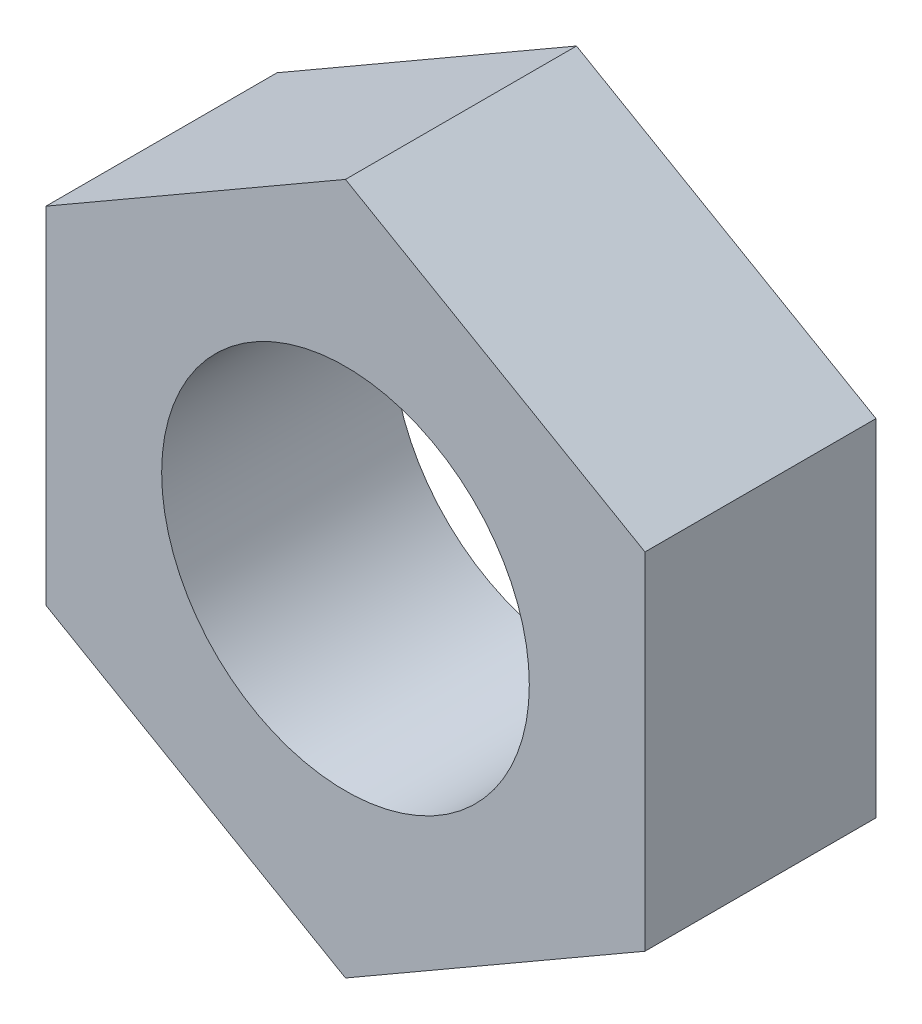
ISO-10303-21;
HEADER;
FILE_DESCRIPTION(('STEP AP214'),'2;1');
FILE_NAME('part.step','',(''),(''),'','','');
FILE_SCHEMA(('AUTOMOTIVE_DESIGN { 1 0 10303 214 1 1 1 1 }'));
ENDSEC;
DATA;
#1=APPLICATION_CONTEXT('core data for automotive mechanical design processes');
#2=APPLICATION_PROTOCOL_DEFINITION('international standard','automotive_design',2000,#1);
#3=PRODUCT_CONTEXT('',#1,'mechanical');
#4=PRODUCT('Part','Part','',(#3));
#5=PRODUCT_RELATED_PRODUCT_CATEGORY('part','',(#4));
#6=PRODUCT_DEFINITION_FORMATION('','',#4);
#7=PRODUCT_DEFINITION_CONTEXT('part definition',#1,'design');
#8=PRODUCT_DEFINITION('design','',#6,#7);
#9=PRODUCT_DEFINITION_SHAPE('','',#8);
#10=(LENGTH_UNIT() NAMED_UNIT(*) SI_UNIT(.MILLI.,.METRE.));
#11=(NAMED_UNIT(*) PLANE_ANGLE_UNIT() SI_UNIT($,.RADIAN.));
#12=(NAMED_UNIT(*) SI_UNIT($,.STERADIAN.) SOLID_ANGLE_UNIT());
#13=UNCERTAINTY_MEASURE_WITH_UNIT(LENGTH_MEASURE(1.E-05),#10,'distance_accuracy_value','');
#14=(GEOMETRIC_REPRESENTATION_CONTEXT(3) GLOBAL_UNCERTAINTY_ASSIGNED_CONTEXT((#13)) GLOBAL_UNIT_ASSIGNED_CONTEXT((#10,
#11,#12)) REPRESENTATION_CONTEXT('',''));
#15=CARTESIAN_POINT('',(0.,0.,0.));
#16=DIRECTION('',(0.,0.,1.));
#17=DIRECTION('',(1.,0.,0.));
#18=AXIS2_PLACEMENT_3D('',#15,#16,#17);
#19=CARTESIAN_POINT('',(0.,8.21223022895323,5.4864));
#20=DIRECTION('',(0.,0.,-1.));
#21=DIRECTION('',(-1.,0.,0.));
#22=AXIS2_PLACEMENT_3D('',#19,#20,#21);
#23=PLANE('',#22);
#24=DIRECTION('',(-0.866025403784438,0.500000000000001,0.));
#25=VECTOR('',#24,1.);
#26=CARTESIAN_POINT('',(0.,8.21223022895323,5.4864));
#27=LINE('',#26,#25);
#28=CARTESIAN_POINT('',(7.112,4.1061151144766,5.4864));
#29=VERTEX_POINT('',#28);
#30=CARTESIAN_POINT('',(0.,8.21223022895323,5.4864));
#31=VERTEX_POINT('',#30);
#32=EDGE_CURVE('E446',#29,#31,#27,.T.);
#33=ORIENTED_EDGE('',*,*,#32,.T.);
#34=DIRECTION('',(-0.866025403784438,-0.500000000000001,0.));
#35=VECTOR('',#34,1.);
#36=CARTESIAN_POINT('',(0.,8.21223022895323,5.4864));
#37=LINE('',#36,#35);
#38=CARTESIAN_POINT('',(-7.112,4.1061151144766,5.4864));
#39=VERTEX_POINT('',#38);
#40=EDGE_CURVE('E427',#31,#39,#37,.T.);
#41=ORIENTED_EDGE('',*,*,#40,.T.);
#42=DIRECTION('',(0.,-1.,0.));
#43=VECTOR('',#42,1.);
#44=CARTESIAN_POINT('',(-7.112,4.1061151144766,5.4864));
#45=LINE('',#44,#43);
#46=CARTESIAN_POINT('',(-7.112,-4.1061151144766,5.4864));
#47=VERTEX_POINT('',#46);
#48=EDGE_CURVE('E449',#39,#47,#45,.T.);
#49=ORIENTED_EDGE('',*,*,#48,.T.);
#50=DIRECTION('',(0.866025403784438,-0.500000000000001,0.));
#51=VECTOR('',#50,1.);
#52=CARTESIAN_POINT('',(-7.112,-4.1061151144766,5.4864));
#53=LINE('',#52,#51);
#54=CARTESIAN_POINT('',(0.,-8.21223022895323,5.4864));
#55=VERTEX_POINT('',#54);
#56=EDGE_CURVE('E451',#47,#55,#53,.T.);
#57=ORIENTED_EDGE('',*,*,#56,.T.);
#58=DIRECTION('',(0.866025403784438,0.500000000000001,0.));
#59=VECTOR('',#58,1.);
#60=CARTESIAN_POINT('',(0.,-8.21223022895323,5.4864));
#61=LINE('',#60,#59);
#62=CARTESIAN_POINT('',(7.112,-4.1061151144766,5.4864));
#63=VERTEX_POINT('',#62);
#64=EDGE_CURVE('E380',#55,#63,#61,.T.);
#65=ORIENTED_EDGE('',*,*,#64,.T.);
#66=DIRECTION('',(0.,1.,0.));
#67=VECTOR('',#66,1.);
#68=CARTESIAN_POINT('',(7.112,4.1061151144766,5.4864));
#69=LINE('',#68,#67);
#70=EDGE_CURVE('E375',#63,#29,#69,.T.);
#71=ORIENTED_EDGE('',*,*,#70,.T.);
#72=EDGE_LOOP('',(#33,#41,#49,#57,#65,#71));
#73=FACE_BOUND('',#72,.T.);
#74=CARTESIAN_POINT('',(0.,0.,5.4864));
#75=DIRECTION('',(0.,0.,1.));
#76=DIRECTION('',(1.,0.,0.));
#77=AXIS2_PLACEMENT_3D('',#74,#75,#76);
#78=CIRCLE('',#77,4.365625);
#79=CARTESIAN_POINT('',(4.365625,0.,5.4864));
#80=VERTEX_POINT('',#79);
#81=EDGE_CURVE('E432',#80,#80,#78,.T.);
#82=ORIENTED_EDGE('',*,*,#81,.F.);
#83=EDGE_LOOP('',(#82));
#84=FACE_BOUND('',#83,.T.);
#85=ADVANCED_FACE('F360',(#73,#84),#23,.F.);
#86=CARTESIAN_POINT('',(0.,8.21223022895323,0.));
#87=DIRECTION('',(0.,0.,-1.));
#88=DIRECTION('',(-1.,0.,0.));
#89=AXIS2_PLACEMENT_3D('',#86,#87,#88);
#90=PLANE('',#89);
#91=DIRECTION('',(-0.866025403784438,0.500000000000001,0.));
#92=VECTOR('',#91,1.);
#93=CARTESIAN_POINT('',(0.,8.21223022895323,0.));
#94=LINE('',#93,#92);
#95=CARTESIAN_POINT('',(7.112,4.1061151144766,0.));
#96=VERTEX_POINT('',#95);
#97=CARTESIAN_POINT('',(0.,8.21223022895323,0.));
#98=VERTEX_POINT('',#97);
#99=EDGE_CURVE('E418',#96,#98,#94,.T.);
#100=ORIENTED_EDGE('',*,*,#99,.F.);
#101=DIRECTION('',(0.,1.,0.));
#102=VECTOR('',#101,1.);
#103=CARTESIAN_POINT('',(7.112,4.1061151144766,0.));
#104=LINE('',#103,#102);
#105=CARTESIAN_POINT('',(7.112,-4.1061151144766,0.));
#106=VERTEX_POINT('',#105);
#107=EDGE_CURVE('E444',#106,#96,#104,.T.);
#108=ORIENTED_EDGE('',*,*,#107,.F.);
#109=DIRECTION('',(0.866025403784438,0.500000000000001,0.));
#110=VECTOR('',#109,1.);
#111=CARTESIAN_POINT('',(0.,-8.21223022895323,0.));
#112=LINE('',#111,#110);
#113=CARTESIAN_POINT('',(0.,-8.21223022895323,0.));
#114=VERTEX_POINT('',#113);
#115=EDGE_CURVE('E442',#114,#106,#112,.T.);
#116=ORIENTED_EDGE('',*,*,#115,.F.);
#117=DIRECTION('',(0.866025403784438,-0.500000000000001,0.));
#118=VECTOR('',#117,1.);
#119=CARTESIAN_POINT('',(-7.112,-4.1061151144766,0.));
#120=LINE('',#119,#118);
#121=CARTESIAN_POINT('',(-7.112,-4.1061151144766,0.));
#122=VERTEX_POINT('',#121);
#123=EDGE_CURVE('E440',#122,#114,#120,.T.);
#124=ORIENTED_EDGE('',*,*,#123,.F.);
#125=DIRECTION('',(0.,-1.,0.));
#126=VECTOR('',#125,1.);
#127=CARTESIAN_POINT('',(-7.112,4.1061151144766,0.));
#128=LINE('',#127,#126);
#129=CARTESIAN_POINT('',(-7.112,4.1061151144766,0.));
#130=VERTEX_POINT('',#129);
#131=EDGE_CURVE('E420',#130,#122,#128,.T.);
#132=ORIENTED_EDGE('',*,*,#131,.F.);
#133=DIRECTION('',(-0.866025403784438,-0.500000000000001,0.));
#134=VECTOR('',#133,1.);
#135=CARTESIAN_POINT('',(0.,8.21223022895323,0.));
#136=LINE('',#135,#134);
#137=EDGE_CURVE('E413',#98,#130,#136,.T.);
#138=ORIENTED_EDGE('',*,*,#137,.F.);
#139=EDGE_LOOP('',(#100,#108,#116,#124,#132,#138));
#140=FACE_BOUND('',#139,.T.);
#141=CARTESIAN_POINT('',(0.,0.,0.));
#142=DIRECTION('',(0.,0.,1.));
#143=DIRECTION('',(1.,0.,0.));
#144=AXIS2_PLACEMENT_3D('',#141,#142,#143);
#145=CIRCLE('',#144,4.365625);
#146=CARTESIAN_POINT('',(4.365625,0.,0.));
#147=VERTEX_POINT('',#146);
#148=EDGE_CURVE('E435',#147,#147,#145,.T.);
#149=ORIENTED_EDGE('',*,*,#148,.T.);
#150=EDGE_LOOP('',(#149));
#151=FACE_BOUND('',#150,.T.);
#152=ADVANCED_FACE('F414',(#140,#151),#90,.T.);
#153=CARTESIAN_POINT('',(0.,8.21223022895323,5.4864));
#154=DIRECTION('',(-0.500000000000001,-0.866025403784438,0.));
#155=DIRECTION('',(0.866025403784438,-0.500000000000001,0.));
#156=AXIS2_PLACEMENT_3D('',#153,#154,#155);
#157=PLANE('',#156);
#158=ORIENTED_EDGE('',*,*,#99,.T.);
#159=DIRECTION('',(0.,0.,-1.));
#160=VECTOR('',#159,1.);
#161=CARTESIAN_POINT('',(0.,8.21223022895323,5.4864));
#162=LINE('',#161,#160);
#163=EDGE_CURVE('E11',#31,#98,#162,.T.);
#164=ORIENTED_EDGE('',*,*,#163,.F.);
#165=ORIENTED_EDGE('',*,*,#32,.F.);
#166=DIRECTION('',(0.,0.,-1.));
#167=VECTOR('',#166,1.);
#168=CARTESIAN_POINT('',(7.112,4.1061151144766,5.4864));
#169=LINE('',#168,#167);
#170=EDGE_CURVE('E431',#29,#96,#169,.T.);
#171=ORIENTED_EDGE('',*,*,#170,.T.);
#172=EDGE_LOOP('',(#158,#164,#165,#171));
#173=FACE_BOUND('',#172,.T.);
#174=ADVANCED_FACE('F362',(#173),#157,.F.);
#175=CARTESIAN_POINT('',(0.,8.21223022895323,5.4864));
#176=DIRECTION('',(0.500000000000001,-0.866025403784438,0.));
#177=DIRECTION('',(0.866025403784438,0.500000000000001,0.));
#178=AXIS2_PLACEMENT_3D('',#175,#176,#177);
#179=PLANE('',#178);
#180=ORIENTED_EDGE('',*,*,#137,.T.);
#181=DIRECTION('',(0.,0.,-1.));
#182=VECTOR('',#181,1.);
#183=CARTESIAN_POINT('',(-7.112,4.1061151144766,5.4864));
#184=LINE('',#183,#182);
#185=EDGE_CURVE('E368',#39,#130,#184,.T.);
#186=ORIENTED_EDGE('',*,*,#185,.F.);
#187=ORIENTED_EDGE('',*,*,#40,.F.);
#188=ORIENTED_EDGE('',*,*,#163,.T.);
#189=EDGE_LOOP('',(#180,#186,#187,#188));
#190=FACE_BOUND('',#189,.T.);
#191=ADVANCED_FACE('F426',(#190),#179,.F.);
#192=CARTESIAN_POINT('',(-7.112,4.1061151144766,5.4864));
#193=DIRECTION('',(1.,0.,0.));
#194=DIRECTION('',(0.,0.,-1.));
#195=AXIS2_PLACEMENT_3D('',#192,#193,#194);
#196=PLANE('',#195);
#197=ORIENTED_EDGE('',*,*,#131,.T.);
#198=DIRECTION('',(0.,0.,-1.));
#199=VECTOR('',#198,1.);
#200=CARTESIAN_POINT('',(-7.112,-4.1061151144766,5.4864));
#201=LINE('',#200,#199);
#202=EDGE_CURVE('E462',#47,#122,#201,.T.);
#203=ORIENTED_EDGE('',*,*,#202,.F.);
#204=ORIENTED_EDGE('',*,*,#48,.F.);
#205=ORIENTED_EDGE('',*,*,#185,.T.);
#206=EDGE_LOOP('',(#197,#203,#204,#205));
#207=FACE_BOUND('',#206,.T.);
#208=ADVANCED_FACE('F466',(#207),#196,.F.);
#209=CARTESIAN_POINT('',(-7.112,-4.1061151144766,5.4864));
#210=DIRECTION('',(0.500000000000001,0.866025403784438,0.));
#211=DIRECTION('',(-0.866025403784438,0.500000000000001,0.));
#212=AXIS2_PLACEMENT_3D('',#209,#210,#211);
#213=PLANE('',#212);
#214=ORIENTED_EDGE('',*,*,#123,.T.);
#215=DIRECTION('',(0.,0.,-1.));
#216=VECTOR('',#215,1.);
#217=CARTESIAN_POINT('',(0.,-8.21223022895323,5.4864));
#218=LINE('',#217,#216);
#219=EDGE_CURVE('E459',#55,#114,#218,.T.);
#220=ORIENTED_EDGE('',*,*,#219,.F.);
#221=ORIENTED_EDGE('',*,*,#56,.F.);
#222=ORIENTED_EDGE('',*,*,#202,.T.);
#223=EDGE_LOOP('',(#214,#220,#221,#222));
#224=FACE_BOUND('',#223,.T.);
#225=ADVANCED_FACE('F472',(#224),#213,.F.);
#226=CARTESIAN_POINT('',(0.,-8.21223022895323,5.4864));
#227=DIRECTION('',(-0.500000000000001,0.866025403784438,0.));
#228=DIRECTION('',(-0.866025403784438,-0.500000000000001,0.));
#229=AXIS2_PLACEMENT_3D('',#226,#227,#228);
#230=PLANE('',#229);
#231=ORIENTED_EDGE('',*,*,#115,.T.);
#232=DIRECTION('',(0.,0.,-1.));
#233=VECTOR('',#232,1.);
#234=CARTESIAN_POINT('',(7.112,-4.1061151144766,5.4864));
#235=LINE('',#234,#233);
#236=EDGE_CURVE('E456',#63,#106,#235,.T.);
#237=ORIENTED_EDGE('',*,*,#236,.F.);
#238=ORIENTED_EDGE('',*,*,#64,.F.);
#239=ORIENTED_EDGE('',*,*,#219,.T.);
#240=EDGE_LOOP('',(#231,#237,#238,#239));
#241=FACE_BOUND('',#240,.T.);
#242=ADVANCED_FACE('F475',(#241),#230,.F.);
#243=CARTESIAN_POINT('',(7.112,4.1061151144766,5.4864));
#244=DIRECTION('',(-1.,0.,0.));
#245=DIRECTION('',(0.,-1.,0.));
#246=AXIS2_PLACEMENT_3D('',#243,#244,#245);
#247=PLANE('',#246);
#248=ORIENTED_EDGE('',*,*,#107,.T.);
#249=ORIENTED_EDGE('',*,*,#170,.F.);
#250=ORIENTED_EDGE('',*,*,#70,.F.);
#251=ORIENTED_EDGE('',*,*,#236,.T.);
#252=EDGE_LOOP('',(#248,#249,#250,#251));
#253=FACE_BOUND('',#252,.T.);
#254=ADVANCED_FACE('F477',(#253),#247,.F.);
#255=CARTESIAN_POINT('',(0.,0.,5.4864));
#256=DIRECTION('',(0.,0.,-1.));
#257=DIRECTION('',(-1.,0.,0.));
#258=AXIS2_PLACEMENT_3D('',#255,#256,#257);
#259=CYLINDRICAL_SURFACE('',#258,4.365625);
#260=ORIENTED_EDGE('',*,*,#81,.T.);
#261=EDGE_LOOP('',(#260));
#262=FACE_BOUND('',#261,.T.);
#263=ORIENTED_EDGE('',*,*,#148,.F.);
#264=EDGE_LOOP('',(#263));
#265=FACE_BOUND('',#264,.T.);
#266=ADVANCED_FACE('F479',(#262,#265),#259,.F.);
#267=CLOSED_SHELL('',(#85,#152,#174,#191,#208,#225,#242,#254,#266));
#268=MANIFOLD_SOLID_BREP('B2',#267);
#269=ADVANCED_BREP_SHAPE_REPRESENTATION('',(#18,#268),#14);
#270=SHAPE_DEFINITION_REPRESENTATION(#9,#269);
ENDSEC;
END-ISO-10303-21;
